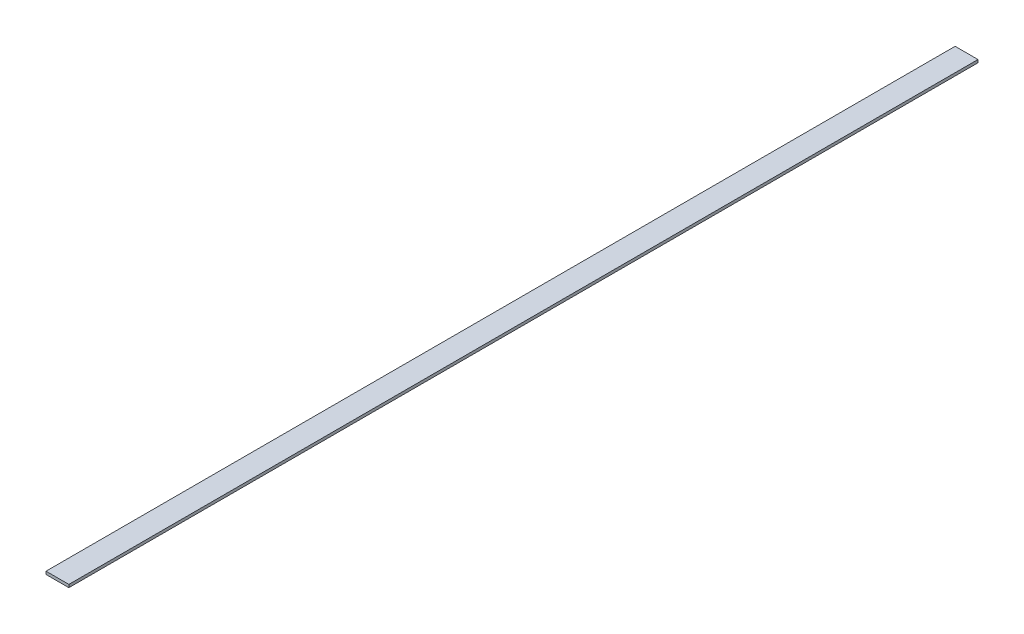
ISO-10303-21;
HEADER;
FILE_DESCRIPTION(('STEP AP214'),'2;1');
FILE_NAME('part.step','',(''),(''),'','','');
FILE_SCHEMA(('AUTOMOTIVE_DESIGN { 1 0 10303 214 1 1 1 1 }'));
ENDSEC;
DATA;
#1=APPLICATION_CONTEXT('core data for automotive mechanical design processes');
#2=APPLICATION_PROTOCOL_DEFINITION('international standard','automotive_design',2000,#1);
#3=PRODUCT_CONTEXT('',#1,'mechanical');
#4=PRODUCT('Part','Part','',(#3));
#5=PRODUCT_RELATED_PRODUCT_CATEGORY('part','',(#4));
#6=PRODUCT_DEFINITION_FORMATION('','',#4);
#7=PRODUCT_DEFINITION_CONTEXT('part definition',#1,'design');
#8=PRODUCT_DEFINITION('design','',#6,#7);
#9=PRODUCT_DEFINITION_SHAPE('','',#8);
#10=(LENGTH_UNIT() NAMED_UNIT(*) SI_UNIT(.MILLI.,.METRE.));
#11=(NAMED_UNIT(*) PLANE_ANGLE_UNIT() SI_UNIT($,.RADIAN.));
#12=(NAMED_UNIT(*) SI_UNIT($,.STERADIAN.) SOLID_ANGLE_UNIT());
#13=UNCERTAINTY_MEASURE_WITH_UNIT(LENGTH_MEASURE(1.E-05),#10,'distance_accuracy_value','');
#14=(GEOMETRIC_REPRESENTATION_CONTEXT(3) GLOBAL_UNCERTAINTY_ASSIGNED_CONTEXT((#13)) GLOBAL_UNIT_ASSIGNED_CONTEXT((#10,
#11,#12)) REPRESENTATION_CONTEXT('',''));
#15=CARTESIAN_POINT('',(0.,0.,0.));
#16=DIRECTION('',(0.,0.,1.));
#17=DIRECTION('',(1.,0.,0.));
#18=AXIS2_PLACEMENT_3D('',#15,#16,#17);
#19=CARTESIAN_POINT('',(0.,1.59,0.));
#20=DIRECTION('',(1.,0.,0.));
#21=DIRECTION('',(0.,0.,-1.));
#22=AXIS2_PLACEMENT_3D('',#19,#20,#21);
#23=PLANE('',#22);
#24=DIRECTION('',(0.,0.,1.));
#25=VECTOR('',#24,1.);
#26=CARTESIAN_POINT('',(0.,0.,0.));
#27=LINE('',#26,#25);
#28=CARTESIAN_POINT('',(0.,0.,-505.));
#29=VERTEX_POINT('',#28);
#30=CARTESIAN_POINT('',(0.,0.,0.));
#31=VERTEX_POINT('',#30);
#32=EDGE_CURVE('E96',#29,#31,#27,.T.);
#33=ORIENTED_EDGE('',*,*,#32,.T.);
#34=DIRECTION('',(0.,-1.,0.));
#35=VECTOR('',#34,1.);
#36=CARTESIAN_POINT('',(0.,1.59,0.));
#37=LINE('',#36,#35);
#38=CARTESIAN_POINT('',(0.,1.59,0.));
#39=VERTEX_POINT('',#38);
#40=EDGE_CURVE('E11',#39,#31,#37,.T.);
#41=ORIENTED_EDGE('',*,*,#40,.F.);
#42=DIRECTION('',(0.,0.,1.));
#43=VECTOR('',#42,1.);
#44=CARTESIAN_POINT('',(0.,1.59,0.));
#45=LINE('',#44,#43);
#46=CARTESIAN_POINT('',(0.,1.59,-505.));
#47=VERTEX_POINT('',#46);
#48=EDGE_CURVE('E84',#47,#39,#45,.T.);
#49=ORIENTED_EDGE('',*,*,#48,.F.);
#50=DIRECTION('',(0.,-1.,0.));
#51=VECTOR('',#50,1.);
#52=CARTESIAN_POINT('',(0.,1.59,-505.));
#53=LINE('',#52,#51);
#54=EDGE_CURVE('E92',#47,#29,#53,.T.);
#55=ORIENTED_EDGE('',*,*,#54,.T.);
#56=EDGE_LOOP('',(#33,#41,#49,#55));
#57=FACE_BOUND('',#56,.T.);
#58=ADVANCED_FACE('F33',(#57),#23,.F.);
#59=CARTESIAN_POINT('',(0.,1.59,0.));
#60=DIRECTION('',(0.,0.,-1.));
#61=DIRECTION('',(-1.,0.,0.));
#62=AXIS2_PLACEMENT_3D('',#59,#60,#61);
#63=PLANE('',#62);
#64=DIRECTION('',(1.,0.,0.));
#65=VECTOR('',#64,1.);
#66=CARTESIAN_POINT('',(0.,0.,0.));
#67=LINE('',#66,#65);
#68=CARTESIAN_POINT('',(12.7,0.,0.));
#69=VERTEX_POINT('',#68);
#70=EDGE_CURVE('E88',#31,#69,#67,.T.);
#71=ORIENTED_EDGE('',*,*,#70,.T.);
#72=DIRECTION('',(0.,-1.,0.));
#73=VECTOR('',#72,1.);
#74=CARTESIAN_POINT('',(12.7,1.59,0.));
#75=LINE('',#74,#73);
#76=CARTESIAN_POINT('',(12.7,1.59,0.));
#77=VERTEX_POINT('',#76);
#78=EDGE_CURVE('E41',#77,#69,#75,.T.);
#79=ORIENTED_EDGE('',*,*,#78,.F.);
#80=DIRECTION('',(1.,0.,0.));
#81=VECTOR('',#80,1.);
#82=CARTESIAN_POINT('',(0.,1.59,0.));
#83=LINE('',#82,#81);
#84=EDGE_CURVE('E79',#39,#77,#83,.T.);
#85=ORIENTED_EDGE('',*,*,#84,.F.);
#86=ORIENTED_EDGE('',*,*,#40,.T.);
#87=EDGE_LOOP('',(#71,#79,#85,#86));
#88=FACE_BOUND('',#87,.T.);
#89=ADVANCED_FACE('F87',(#88),#63,.F.);
#90=CARTESIAN_POINT('',(12.7,1.59,0.));
#91=DIRECTION('',(-1.,0.,0.));
#92=DIRECTION('',(0.,0.,1.));
#93=AXIS2_PLACEMENT_3D('',#90,#91,#92);
#94=PLANE('',#93);
#95=DIRECTION('',(0.,0.,-1.));
#96=VECTOR('',#95,1.);
#97=CARTESIAN_POINT('',(12.7,0.,0.));
#98=LINE('',#97,#96);
#99=CARTESIAN_POINT('',(12.7,0.,-505.));
#100=VERTEX_POINT('',#99);
#101=EDGE_CURVE('E66',#69,#100,#98,.T.);
#102=ORIENTED_EDGE('',*,*,#101,.T.);
#103=DIRECTION('',(0.,-1.,0.));
#104=VECTOR('',#103,1.);
#105=CARTESIAN_POINT('',(12.7,1.59,-505.));
#106=LINE('',#105,#104);
#107=CARTESIAN_POINT('',(12.7,1.59,-505.));
#108=VERTEX_POINT('',#107);
#109=EDGE_CURVE('E89',#108,#100,#106,.T.);
#110=ORIENTED_EDGE('',*,*,#109,.F.);
#111=DIRECTION('',(0.,0.,-1.));
#112=VECTOR('',#111,1.);
#113=CARTESIAN_POINT('',(12.7,1.59,0.));
#114=LINE('',#113,#112);
#115=EDGE_CURVE('E82',#77,#108,#114,.T.);
#116=ORIENTED_EDGE('',*,*,#115,.F.);
#117=ORIENTED_EDGE('',*,*,#78,.T.);
#118=EDGE_LOOP('',(#102,#110,#116,#117));
#119=FACE_BOUND('',#118,.T.);
#120=ADVANCED_FACE('F90',(#119),#94,.F.);
#121=CARTESIAN_POINT('',(0.,1.59,-505.));
#122=DIRECTION('',(0.,0.,1.));
#123=DIRECTION('',(1.,0.,0.));
#124=AXIS2_PLACEMENT_3D('',#121,#122,#123);
#125=PLANE('',#124);
#126=DIRECTION('',(-1.,0.,0.));
#127=VECTOR('',#126,1.);
#128=CARTESIAN_POINT('',(0.,0.,-505.));
#129=LINE('',#128,#127);
#130=EDGE_CURVE('E72',#100,#29,#129,.T.);
#131=ORIENTED_EDGE('',*,*,#130,.T.);
#132=ORIENTED_EDGE('',*,*,#54,.F.);
#133=DIRECTION('',(-1.,0.,0.));
#134=VECTOR('',#133,1.);
#135=CARTESIAN_POINT('',(0.,1.59,-505.));
#136=LINE('',#135,#134);
#137=EDGE_CURVE('E49',#108,#47,#136,.T.);
#138=ORIENTED_EDGE('',*,*,#137,.F.);
#139=ORIENTED_EDGE('',*,*,#109,.T.);
#140=EDGE_LOOP('',(#131,#132,#138,#139));
#141=FACE_BOUND('',#140,.T.);
#142=ADVANCED_FACE('F103',(#141),#125,.F.);
#143=CARTESIAN_POINT('',(0.,1.59,0.));
#144=DIRECTION('',(0.,-1.,0.));
#145=DIRECTION('',(0.,0.,-1.));
#146=AXIS2_PLACEMENT_3D('',#143,#144,#145);
#147=PLANE('',#146);
#148=ORIENTED_EDGE('',*,*,#48,.T.);
#149=ORIENTED_EDGE('',*,*,#84,.T.);
#150=ORIENTED_EDGE('',*,*,#115,.T.);
#151=ORIENTED_EDGE('',*,*,#137,.T.);
#152=EDGE_LOOP('',(#148,#149,#150,#151));
#153=FACE_BOUND('',#152,.T.);
#154=ADVANCED_FACE('F80',(#153),#147,.F.);
#155=CARTESIAN_POINT('',(0.,0.,0.));
#156=DIRECTION('',(0.,-1.,0.));
#157=DIRECTION('',(0.,0.,-1.));
#158=AXIS2_PLACEMENT_3D('',#155,#156,#157);
#159=PLANE('',#158);
#160=ORIENTED_EDGE('',*,*,#32,.F.);
#161=ORIENTED_EDGE('',*,*,#130,.F.);
#162=ORIENTED_EDGE('',*,*,#101,.F.);
#163=ORIENTED_EDGE('',*,*,#70,.F.);
#164=EDGE_LOOP('',(#160,#161,#162,#163));
#165=FACE_BOUND('',#164,.T.);
#166=ADVANCED_FACE('F106',(#165),#159,.T.);
#167=CLOSED_SHELL('',(#58,#89,#120,#142,#154,#166));
#168=MANIFOLD_SOLID_BREP('B2',#167);
#169=ADVANCED_BREP_SHAPE_REPRESENTATION('',(#18,#168),#14);
#170=SHAPE_DEFINITION_REPRESENTATION(#9,#169);
ENDSEC;
END-ISO-10303-21;
